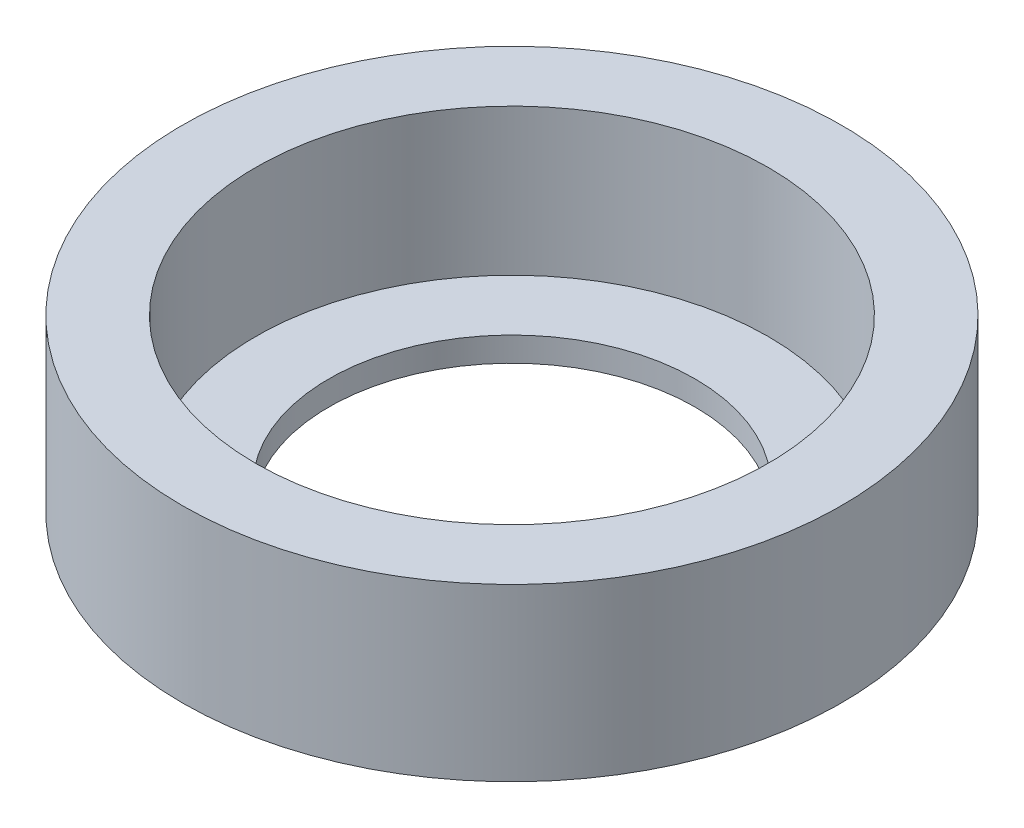
ISO-10303-21;
HEADER;
FILE_DESCRIPTION(('STEP AP214'),'2;1');
FILE_NAME('part.step','',(''),(''),'','','');
FILE_SCHEMA(('AUTOMOTIVE_DESIGN { 1 0 10303 214 1 1 1 1 }'));
ENDSEC;
DATA;
#1=APPLICATION_CONTEXT('core data for automotive mechanical design processes');
#2=APPLICATION_PROTOCOL_DEFINITION('international standard','automotive_design',2000,#1);
#3=PRODUCT_CONTEXT('',#1,'mechanical');
#4=PRODUCT('Part','Part','',(#3));
#5=PRODUCT_RELATED_PRODUCT_CATEGORY('part','',(#4));
#6=PRODUCT_DEFINITION_FORMATION('','',#4);
#7=PRODUCT_DEFINITION_CONTEXT('part definition',#1,'design');
#8=PRODUCT_DEFINITION('design','',#6,#7);
#9=PRODUCT_DEFINITION_SHAPE('','',#8);
#10=(LENGTH_UNIT() NAMED_UNIT(*) SI_UNIT(.MILLI.,.METRE.));
#11=(NAMED_UNIT(*) PLANE_ANGLE_UNIT() SI_UNIT($,.RADIAN.));
#12=(NAMED_UNIT(*) SI_UNIT($,.STERADIAN.) SOLID_ANGLE_UNIT());
#13=UNCERTAINTY_MEASURE_WITH_UNIT(LENGTH_MEASURE(1.E-05),#10,'distance_accuracy_value','');
#14=(GEOMETRIC_REPRESENTATION_CONTEXT(3) GLOBAL_UNCERTAINTY_ASSIGNED_CONTEXT((#13)) GLOBAL_UNIT_ASSIGNED_CONTEXT((#10,
#11,#12)) REPRESENTATION_CONTEXT('',''));
#15=CARTESIAN_POINT('',(0.,0.,0.));
#16=DIRECTION('',(0.,0.,1.));
#17=DIRECTION('',(1.,0.,0.));
#18=AXIS2_PLACEMENT_3D('',#15,#16,#17);
#19=CARTESIAN_POINT('',(0.,7.,0.));
#20=DIRECTION('',(0.,-1.,0.));
#21=DIRECTION('',(0.,0.,-1.));
#22=AXIS2_PLACEMENT_3D('',#19,#20,#21);
#23=CYLINDRICAL_SURFACE('',#22,7.5);
#24=CARTESIAN_POINT('',(0.,0.,0.));
#25=DIRECTION('',(0.,1.,0.));
#26=DIRECTION('',(0.,0.,1.));
#27=AXIS2_PLACEMENT_3D('',#24,#25,#26);
#28=CIRCLE('',#27,7.5);
#29=CARTESIAN_POINT('',(0.,0.,7.5));
#30=VERTEX_POINT('',#29);
#31=EDGE_CURVE('E48',#30,#30,#28,.T.);
#32=ORIENTED_EDGE('',*,*,#31,.F.);
#33=EDGE_LOOP('',(#32));
#34=FACE_BOUND('',#33,.T.);
#35=CARTESIAN_POINT('',(0.,1.,0.));
#36=DIRECTION('',(0.,1.,0.));
#37=DIRECTION('',(0.,0.,1.));
#38=AXIS2_PLACEMENT_3D('',#35,#36,#37);
#39=CIRCLE('',#38,7.5);
#40=CARTESIAN_POINT('',(0.,1.,7.5));
#41=VERTEX_POINT('',#40);
#42=EDGE_CURVE('E39',#41,#41,#39,.T.);
#43=ORIENTED_EDGE('',*,*,#42,.T.);
#44=EDGE_LOOP('',(#43));
#45=FACE_BOUND('',#44,.T.);
#46=ADVANCED_FACE('F35',(#34,#45),#23,.F.);
#47=CARTESIAN_POINT('',(0.,7.,0.));
#48=DIRECTION('',(0.,1.,0.));
#49=DIRECTION('',(0.,0.,1.));
#50=AXIS2_PLACEMENT_3D('',#47,#48,#49);
#51=PLANE('',#50);
#52=CARTESIAN_POINT('',(0.,7.,0.));
#53=DIRECTION('',(0.,1.,0.));
#54=DIRECTION('',(0.,0.,1.));
#55=AXIS2_PLACEMENT_3D('',#52,#53,#54);
#56=CIRCLE('',#55,10.5);
#57=CARTESIAN_POINT('',(0.,7.,10.5));
#58=VERTEX_POINT('',#57);
#59=EDGE_CURVE('E52',#58,#58,#56,.T.);
#60=ORIENTED_EDGE('',*,*,#59,.F.);
#61=EDGE_LOOP('',(#60));
#62=FACE_BOUND('',#61,.T.);
#63=CARTESIAN_POINT('',(0.,7.,0.));
#64=DIRECTION('',(0.,1.,0.));
#65=DIRECTION('',(0.,0.,1.));
#66=AXIS2_PLACEMENT_3D('',#63,#64,#65);
#67=CIRCLE('',#66,13.5);
#68=CARTESIAN_POINT('',(0.,7.,13.5));
#69=VERTEX_POINT('',#68);
#70=EDGE_CURVE('E10',#69,#69,#67,.T.);
#71=ORIENTED_EDGE('',*,*,#70,.T.);
#72=EDGE_LOOP('',(#71));
#73=FACE_BOUND('',#72,.T.);
#74=ADVANCED_FACE('F73',(#62,#73),#51,.T.);
#75=CARTESIAN_POINT('',(0.,0.,0.));
#76=DIRECTION('',(0.,1.,0.));
#77=DIRECTION('',(0.,0.,1.));
#78=AXIS2_PLACEMENT_3D('',#75,#76,#77);
#79=PLANE('',#78);
#80=CARTESIAN_POINT('',(0.,0.,0.));
#81=DIRECTION('',(0.,1.,0.));
#82=DIRECTION('',(0.,0.,1.));
#83=AXIS2_PLACEMENT_3D('',#80,#81,#82);
#84=CIRCLE('',#83,13.5);
#85=CARTESIAN_POINT('',(0.,0.,13.5));
#86=VERTEX_POINT('',#85);
#87=EDGE_CURVE('E43',#86,#86,#84,.T.);
#88=ORIENTED_EDGE('',*,*,#87,.F.);
#89=EDGE_LOOP('',(#88));
#90=FACE_BOUND('',#89,.T.);
#91=ORIENTED_EDGE('',*,*,#31,.T.);
#92=EDGE_LOOP('',(#91));
#93=FACE_BOUND('',#92,.T.);
#94=ADVANCED_FACE('F79',(#90,#93),#79,.F.);
#95=CARTESIAN_POINT('',(0.,7.,0.));
#96=DIRECTION('',(0.,-1.,0.));
#97=DIRECTION('',(0.,0.,-1.));
#98=AXIS2_PLACEMENT_3D('',#95,#96,#97);
#99=CYLINDRICAL_SURFACE('',#98,13.5);
#100=ORIENTED_EDGE('',*,*,#70,.F.);
#101=EDGE_LOOP('',(#100));
#102=FACE_BOUND('',#101,.T.);
#103=ORIENTED_EDGE('',*,*,#87,.T.);
#104=EDGE_LOOP('',(#103));
#105=FACE_BOUND('',#104,.T.);
#106=ADVANCED_FACE('F37',(#102,#105),#99,.T.);
#107=CARTESIAN_POINT('',(0.,1.,0.));
#108=DIRECTION('',(0.,1.,0.));
#109=DIRECTION('',(0.,0.,1.));
#110=AXIS2_PLACEMENT_3D('',#107,#108,#109);
#111=CYLINDRICAL_SURFACE('',#110,10.5);
#112=CARTESIAN_POINT('',(0.,1.,0.));
#113=DIRECTION('',(0.,1.,0.));
#114=DIRECTION('',(0.,0.,1.));
#115=AXIS2_PLACEMENT_3D('',#112,#113,#114);
#116=CIRCLE('',#115,10.5);
#117=CARTESIAN_POINT('',(0.,1.,10.5));
#118=VERTEX_POINT('',#117);
#119=EDGE_CURVE('E55',#118,#118,#116,.T.);
#120=ORIENTED_EDGE('',*,*,#119,.F.);
#121=EDGE_LOOP('',(#120));
#122=FACE_BOUND('',#121,.T.);
#123=ORIENTED_EDGE('',*,*,#59,.T.);
#124=EDGE_LOOP('',(#123));
#125=FACE_BOUND('',#124,.T.);
#126=ADVANCED_FACE('F65',(#122,#125),#111,.F.);
#127=CARTESIAN_POINT('',(0.,1.,0.));
#128=DIRECTION('',(0.,1.,0.));
#129=DIRECTION('',(0.,0.,1.));
#130=AXIS2_PLACEMENT_3D('',#127,#128,#129);
#131=PLANE('',#130);
#132=ORIENTED_EDGE('',*,*,#42,.F.);
#133=EDGE_LOOP('',(#132));
#134=FACE_BOUND('',#133,.T.);
#135=ORIENTED_EDGE('',*,*,#119,.T.);
#136=EDGE_LOOP('',(#135));
#137=FACE_BOUND('',#136,.T.);
#138=ADVANCED_FACE('F63',(#134,#137),#131,.T.);
#139=CLOSED_SHELL('',(#46,#74,#94,#106,#126,#138));
#140=MANIFOLD_SOLID_BREP('B2',#139);
#141=ADVANCED_BREP_SHAPE_REPRESENTATION('',(#18,#140),#14);
#142=SHAPE_DEFINITION_REPRESENTATION(#9,#141);
ENDSEC;
END-ISO-10303-21;
